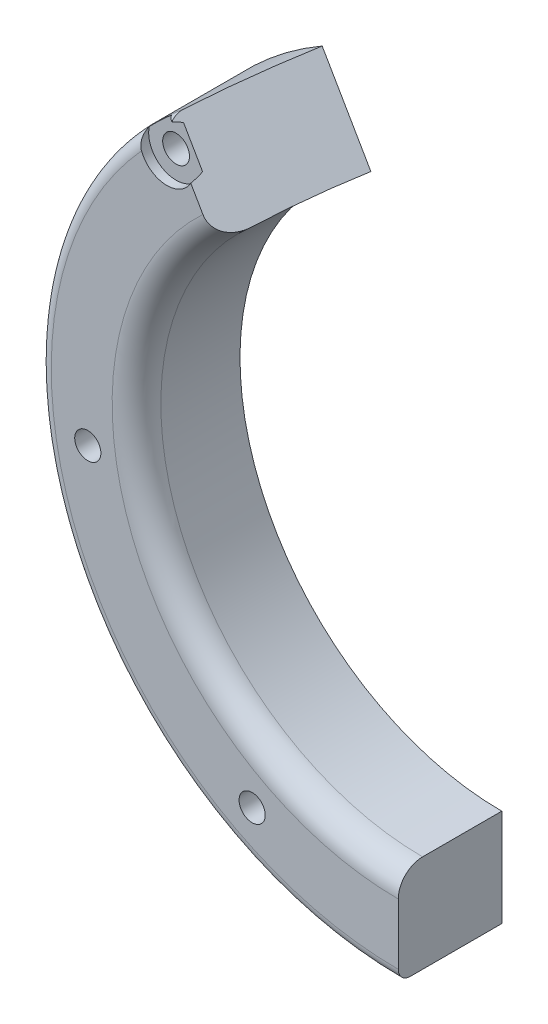
ISO-10303-21;
HEADER;
FILE_DESCRIPTION(('STEP AP214'),'2;1');
FILE_NAME('part.step','',(''),(''),'','','');
FILE_SCHEMA(('AUTOMOTIVE_DESIGN { 1 0 10303 214 1 1 1 1 }'));
ENDSEC;
DATA;
#1=APPLICATION_CONTEXT('core data for automotive mechanical design processes');
#2=APPLICATION_PROTOCOL_DEFINITION('international standard','automotive_design',2000,#1);
#3=PRODUCT_CONTEXT('',#1,'mechanical');
#4=PRODUCT('Part','Part','',(#3));
#5=PRODUCT_RELATED_PRODUCT_CATEGORY('part','',(#4));
#6=PRODUCT_DEFINITION_FORMATION('','',#4);
#7=PRODUCT_DEFINITION_CONTEXT('part definition',#1,'design');
#8=PRODUCT_DEFINITION('design','',#6,#7);
#9=PRODUCT_DEFINITION_SHAPE('','',#8);
#10=(LENGTH_UNIT() NAMED_UNIT(*) SI_UNIT(.MILLI.,.METRE.));
#11=(NAMED_UNIT(*) PLANE_ANGLE_UNIT() SI_UNIT($,.RADIAN.));
#12=(NAMED_UNIT(*) SI_UNIT($,.STERADIAN.) SOLID_ANGLE_UNIT());
#13=UNCERTAINTY_MEASURE_WITH_UNIT(LENGTH_MEASURE(1.E-05),#10,'distance_accuracy_value','');
#14=(GEOMETRIC_REPRESENTATION_CONTEXT(3) GLOBAL_UNCERTAINTY_ASSIGNED_CONTEXT((#13)) GLOBAL_UNIT_ASSIGNED_CONTEXT((#10,
#11,#12)) REPRESENTATION_CONTEXT('',''));
#15=CARTESIAN_POINT('',(0.,0.,0.));
#16=DIRECTION('',(0.,0.,1.));
#17=DIRECTION('',(1.,0.,0.));
#18=AXIS2_PLACEMENT_3D('',#15,#16,#17);
#19=CARTESIAN_POINT('',(-51.,-8.,17.2023186219581));
#20=DIRECTION('',(0.,0.,-1.));
#21=DIRECTION('',(-1.,0.,0.));
#22=AXIS2_PLACEMENT_3D('',#19,#20,#21);
#23=CYLINDRICAL_SURFACE('',#22,1.25000000000001);
#24=CARTESIAN_POINT('',(-51.,-8.,0.));
#25=DIRECTION('',(0.,0.,-1.));
#26=DIRECTION('',(-1.,0.,0.));
#27=AXIS2_PLACEMENT_3D('',#24,#25,#26);
#28=CIRCLE('',#27,1.25000000000001);
#29=CARTESIAN_POINT('',(-52.25,-8.,0.));
#30=VERTEX_POINT('',#29);
#31=EDGE_CURVE('E353',#30,#30,#28,.T.);
#32=ORIENTED_EDGE('',*,*,#31,.T.);
#33=EDGE_LOOP('',(#32));
#34=FACE_BOUND('',#33,.T.);
#35=CARTESIAN_POINT('',(-51.,-8.,3.));
#36=DIRECTION('',(0.,0.,1.));
#37=DIRECTION('',(1.,0.,0.));
#38=AXIS2_PLACEMENT_3D('',#35,#36,#37);
#39=CIRCLE('',#38,1.25000000000001);
#40=CARTESIAN_POINT('',(-49.75,-8.,3.));
#41=VERTEX_POINT('',#40);
#42=EDGE_CURVE('E351',#41,#41,#39,.F.);
#43=ORIENTED_EDGE('',*,*,#42,.F.);
#44=EDGE_LOOP('',(#43));
#45=FACE_BOUND('',#44,.T.);
#46=ADVANCED_FACE('F39',(#34,#45),#23,.F.);
#47=CARTESIAN_POINT('',(-24.,-46.,17.2023186219581));
#48=DIRECTION('',(0.,0.,-1.));
#49=DIRECTION('',(-1.,0.,0.));
#50=AXIS2_PLACEMENT_3D('',#47,#48,#49);
#51=CYLINDRICAL_SURFACE('',#50,1.25);
#52=CARTESIAN_POINT('',(-24.,-46.,0.));
#53=DIRECTION('',(0.,0.,-1.));
#54=DIRECTION('',(-1.,0.,0.));
#55=AXIS2_PLACEMENT_3D('',#52,#53,#54);
#56=CIRCLE('',#55,1.25);
#57=CARTESIAN_POINT('',(-25.25,-46.,0.));
#58=VERTEX_POINT('',#57);
#59=EDGE_CURVE('E186',#58,#58,#56,.T.);
#60=ORIENTED_EDGE('',*,*,#59,.T.);
#61=EDGE_LOOP('',(#60));
#62=FACE_BOUND('',#61,.T.);
#63=CARTESIAN_POINT('',(-24.,-46.,3.));
#64=DIRECTION('',(0.,0.,1.));
#65=DIRECTION('',(1.,0.,0.));
#66=AXIS2_PLACEMENT_3D('',#63,#64,#65);
#67=CIRCLE('',#66,1.25);
#68=CARTESIAN_POINT('',(-22.75,-46.,3.));
#69=VERTEX_POINT('',#68);
#70=EDGE_CURVE('E348',#69,#69,#67,.F.);
#71=ORIENTED_EDGE('',*,*,#70,.F.);
#72=EDGE_LOOP('',(#71));
#73=FACE_BOUND('',#72,.T.);
#74=ADVANCED_FACE('F387',(#62,#73),#51,.F.);
#75=CARTESIAN_POINT('',(-38.,40.,0.));
#76=DIRECTION('',(0.,0.,1.));
#77=DIRECTION('',(1.,0.,0.));
#78=AXIS2_PLACEMENT_3D('',#75,#76,#77);
#79=CYLINDRICAL_SURFACE('',#78,2.2);
#80=CARTESIAN_POINT('',(-38.,40.,0.));
#81=DIRECTION('',(0.,0.,1.));
#82=DIRECTION('',(1.,0.,0.));
#83=AXIS2_PLACEMENT_3D('',#80,#81,#82);
#84=CIRCLE('',#83,2.2);
#85=CARTESIAN_POINT('',(-35.8,40.,0.));
#86=VERTEX_POINT('',#85);
#87=EDGE_CURVE('E224',#86,#86,#84,.T.);
#88=ORIENTED_EDGE('',*,*,#87,.F.);
#89=EDGE_LOOP('',(#88));
#90=FACE_BOUND('',#89,.T.);
#91=CARTESIAN_POINT('',(-38.,40.,2.));
#92=DIRECTION('',(0.,0.,1.));
#93=DIRECTION('',(1.,0.,0.));
#94=AXIS2_PLACEMENT_3D('',#91,#92,#93);
#95=CIRCLE('',#94,2.2);
#96=CARTESIAN_POINT('',(-35.8,40.,2.));
#97=VERTEX_POINT('',#96);
#98=EDGE_CURVE('E201',#97,#97,#95,.F.);
#99=ORIENTED_EDGE('',*,*,#98,.F.);
#100=EDGE_LOOP('',(#99));
#101=FACE_BOUND('',#100,.T.);
#102=ADVANCED_FACE('F300',(#90,#101),#79,.F.);
#103=CARTESIAN_POINT('',(-38.,40.,6.));
#104=DIRECTION('',(0.,0.,1.));
#105=DIRECTION('',(1.,0.,0.));
#106=AXIS2_PLACEMENT_3D('',#103,#104,#105);
#107=CIRCLE('',#106,2.2);
#108=CARTESIAN_POINT('',(-35.8,40.,6.));
#109=VERTEX_POINT('',#108);
#110=EDGE_CURVE('E210',#109,#109,#107,.F.);
#111=ORIENTED_EDGE('',*,*,#110,.T.);
#112=EDGE_LOOP('',(#111));
#113=FACE_BOUND('',#112,.T.);
#114=CARTESIAN_POINT('',(-38.,40.,15.5));
#115=DIRECTION('',(0.,0.,1.));
#116=DIRECTION('',(1.,0.,0.));
#117=AXIS2_PLACEMENT_3D('',#114,#115,#116);
#118=CIRCLE('',#117,2.2);
#119=CARTESIAN_POINT('',(-35.8,40.,15.5));
#120=VERTEX_POINT('',#119);
#121=EDGE_CURVE('E212',#120,#120,#118,.F.);
#122=ORIENTED_EDGE('',*,*,#121,.F.);
#123=EDGE_LOOP('',(#122));
#124=FACE_BOUND('',#123,.T.);
#125=ADVANCED_FACE('F279',(#113,#124),#79,.F.);
#126=CARTESIAN_POINT('',(0.,0.,17.));
#127=DIRECTION('',(0.,0.,-1.));
#128=DIRECTION('',(-1.,0.,0.));
#129=AXIS2_PLACEMENT_3D('',#126,#127,#128);
#130=CYLINDRICAL_SURFACE('',#129,43.);
#131=DIRECTION('',(0.,0.,-1.));
#132=VECTOR('',#131,1.);
#133=CARTESIAN_POINT('',(-33.2355244808769,27.2836931605865,17.));
#134=LINE('',#133,#132);
#135=CARTESIAN_POINT('',(-33.2355244808769,27.2836931605865,2.));
#136=VERTEX_POINT('',#135);
#137=CARTESIAN_POINT('',(-33.2355244808769,27.2836931605865,6.));
#138=VERTEX_POINT('',#137);
#139=EDGE_CURVE('E343',#136,#138,#134,.F.);
#140=ORIENTED_EDGE('',*,*,#139,.T.);
#141=CARTESIAN_POINT('',(0.,0.,6.));
#142=DIRECTION('',(0.,0.,1.));
#143=DIRECTION('',(1.,0.,0.));
#144=AXIS2_PLACEMENT_3D('',#141,#142,#143);
#145=CIRCLE('',#144,43.);
#146=CARTESIAN_POINT('',(-26.3105496569665,34.011100787071,6.));
#147=VERTEX_POINT('',#146);
#148=EDGE_CURVE('E163',#138,#147,#145,.F.);
#149=ORIENTED_EDGE('',*,*,#148,.T.);
#150=DIRECTION('',(0.,0.,-1.));
#151=VECTOR('',#150,1.);
#152=CARTESIAN_POINT('',(-26.3105496569665,34.011100787071,17.));
#153=LINE('',#152,#151);
#154=CARTESIAN_POINT('',(-26.3105496569665,34.011100787071,2.));
#155=VERTEX_POINT('',#154);
#156=EDGE_CURVE('E344',#147,#155,#153,.T.);
#157=ORIENTED_EDGE('',*,*,#156,.T.);
#158=CARTESIAN_POINT('',(0.,0.,2.));
#159=DIRECTION('',(0.,0.,1.));
#160=DIRECTION('',(1.,0.,0.));
#161=AXIS2_PLACEMENT_3D('',#158,#159,#160);
#162=CIRCLE('',#161,43.);
#163=EDGE_CURVE('E338',#136,#155,#162,.F.);
#164=ORIENTED_EDGE('',*,*,#163,.F.);
#165=EDGE_LOOP('',(#140,#149,#157,#164));
#166=FACE_BOUND('',#165,.T.);
#167=CARTESIAN_POINT('',(0.,0.,0.));
#168=DIRECTION('',(0.734431194902493,0.424024048078214,0.529919264233205));
#169=DIRECTION('',(0.458923544780714,0.264959632116603,-0.848048096156426));
#170=AXIS2_PLACEMENT_3D('',#167,#168,#169);
#171=ELLIPSE('',#170,81.1444363363938,43.);
#172=CARTESIAN_POINT('',(-21.5000000000001,37.2390923627308,0.));
#173=VERTEX_POINT('',#172);
#174=CARTESIAN_POINT('',(-28.147848735378,32.5069009837954,13.));
#175=VERTEX_POINT('',#174);
#176=EDGE_CURVE('E230',#173,#175,#171,.T.);
#177=ORIENTED_EDGE('',*,*,#176,.T.);
#178=CARTESIAN_POINT('',(0.,0.,13.));
#179=DIRECTION('',(0.,0.,1.));
#180=DIRECTION('',(1.,0.,0.));
#181=AXIS2_PLACEMENT_3D('',#178,#179,#180);
#182=CIRCLE('',#181,43.);
#183=CARTESIAN_POINT('',(0.,-43.,13.));
#184=VERTEX_POINT('',#183);
#185=EDGE_CURVE('E263',#175,#184,#182,.T.);
#186=ORIENTED_EDGE('',*,*,#185,.T.);
#187=DIRECTION('',(0.,0.,-1.));
#188=VECTOR('',#187,1.);
#189=CARTESIAN_POINT('',(0.,-43.,17.));
#190=LINE('',#189,#188);
#191=CARTESIAN_POINT('',(0.,-43.,0.));
#192=VERTEX_POINT('',#191);
#193=EDGE_CURVE('E235',#184,#192,#190,.T.);
#194=ORIENTED_EDGE('',*,*,#193,.T.);
#195=CARTESIAN_POINT('',(0.,0.,0.));
#196=DIRECTION('',(0.,0.,-1.));
#197=DIRECTION('',(1.,0.,0.));
#198=AXIS2_PLACEMENT_3D('',#195,#196,#197);
#199=CIRCLE('',#198,43.);
#200=EDGE_CURVE('E226',#192,#173,#199,.T.);
#201=ORIENTED_EDGE('',*,*,#200,.T.);
#202=EDGE_LOOP('',(#177,#186,#194,#201));
#203=FACE_BOUND('',#202,.T.);
#204=ADVANCED_FACE('F273',(#166,#203),#130,.F.);
#205=CARTESIAN_POINT('',(0.,0.,17.));
#206=DIRECTION('',(0.,0.,-1.));
#207=DIRECTION('',(-1.,0.,0.));
#208=AXIS2_PLACEMENT_3D('',#205,#206,#207);
#209=CYLINDRICAL_SURFACE('',#208,59.);
#210=DIRECTION('',(0.,0.,-1.));
#211=VECTOR('',#210,1.);
#212=CARTESIAN_POINT('',(0.,-59.,17.));
#213=LINE('',#212,#211);
#214=CARTESIAN_POINT('',(0.,-59.,15.));
#215=VERTEX_POINT('',#214);
#216=CARTESIAN_POINT('',(0.,-59.,0.));
#217=VERTEX_POINT('',#216);
#218=EDGE_CURVE('E223',#215,#217,#213,.T.);
#219=ORIENTED_EDGE('',*,*,#218,.F.);
#220=CARTESIAN_POINT('',(0.,0.,15.));
#221=DIRECTION('',(0.,0.,1.));
#222=DIRECTION('',(1.,0.,0.));
#223=AXIS2_PLACEMENT_3D('',#220,#221,#222);
#224=CIRCLE('',#223,59.);
#225=CARTESIAN_POINT('',(-37.2426498564599,45.7600812026063,15.));
#226=VERTEX_POINT('',#225);
#227=EDGE_CURVE('E52',#215,#226,#224,.F.);
#228=ORIENTED_EDGE('',*,*,#227,.T.);
#229=CARTESIAN_POINT('',(0.,0.,0.));
#230=DIRECTION('',(0.734431194902493,0.424024048078214,0.529919264233205));
#231=DIRECTION('',(0.458923544780714,0.264959632116603,-0.848048096156426));
#232=AXIS2_PLACEMENT_3D('',#229,#230,#231);
#233=ELLIPSE('',#232,111.337714973192,59.);
#234=CARTESIAN_POINT('',(-29.5000000000001,51.0954988232818,0.));
#235=VERTEX_POINT('',#234);
#236=EDGE_CURVE('E244',#226,#235,#233,.F.);
#237=ORIENTED_EDGE('',*,*,#236,.T.);
#238=CARTESIAN_POINT('',(0.,0.,0.));
#239=DIRECTION('',(0.,0.,1.));
#240=DIRECTION('',(1.,0.,0.));
#241=AXIS2_PLACEMENT_3D('',#238,#239,#240);
#242=CIRCLE('',#241,59.);
#243=EDGE_CURVE('E236',#235,#217,#242,.T.);
#244=ORIENTED_EDGE('',*,*,#243,.T.);
#245=EDGE_LOOP('',(#219,#228,#237,#244));
#246=FACE_BOUND('',#245,.T.);
#247=ADVANCED_FACE('F277',(#246),#209,.T.);
#248=CARTESIAN_POINT('',(0.,-43.,17.));
#249=DIRECTION('',(-1.,0.,0.));
#250=DIRECTION('',(0.,-1.,0.));
#251=AXIS2_PLACEMENT_3D('',#248,#249,#250);
#252=PLANE('',#251);
#253=DIRECTION('',(0.,1.,0.));
#254=VECTOR('',#253,1.);
#255=CARTESIAN_POINT('',(0.,-43.,17.));
#256=LINE('',#255,#254);
#257=CARTESIAN_POINT('',(0.,-57.,17.));
#258=VERTEX_POINT('',#257);
#259=CARTESIAN_POINT('',(0.,-47.,17.));
#260=VERTEX_POINT('',#259);
#261=EDGE_CURVE('E229',#258,#260,#256,.T.);
#262=ORIENTED_EDGE('',*,*,#261,.F.);
#263=CARTESIAN_POINT('',(0.,-57.,15.));
#264=DIRECTION('',(-1.,0.,0.));
#265=DIRECTION('',(0.,-1.,0.));
#266=AXIS2_PLACEMENT_3D('',#263,#264,#265);
#267=CIRCLE('',#266,2.);
#268=EDGE_CURVE('E66',#258,#215,#267,.F.);
#269=ORIENTED_EDGE('',*,*,#268,.T.);
#270=ORIENTED_EDGE('',*,*,#218,.T.);
#271=DIRECTION('',(0.,1.,0.));
#272=VECTOR('',#271,1.);
#273=CARTESIAN_POINT('',(0.,-43.,0.));
#274=LINE('',#273,#272);
#275=EDGE_CURVE('E231',#217,#192,#274,.T.);
#276=ORIENTED_EDGE('',*,*,#275,.T.);
#277=ORIENTED_EDGE('',*,*,#193,.F.);
#278=CARTESIAN_POINT('',(0.,-47.,13.));
#279=DIRECTION('',(-1.,0.,0.));
#280=DIRECTION('',(0.,-1.,0.));
#281=AXIS2_PLACEMENT_3D('',#278,#279,#280);
#282=CIRCLE('',#281,4.);
#283=EDGE_CURVE('E334',#184,#260,#282,.F.);
#284=ORIENTED_EDGE('',*,*,#283,.T.);
#285=EDGE_LOOP('',(#262,#269,#270,#276,#277,#284));
#286=FACE_BOUND('',#285,.T.);
#287=ADVANCED_FACE('F283',(#286),#252,.F.);
#288=CARTESIAN_POINT('',(0.,0.,17.));
#289=DIRECTION('',(0.,0.,1.));
#290=DIRECTION('',(1.,0.,0.));
#291=AXIS2_PLACEMENT_3D('',#288,#289,#290);
#292=PLANE('',#291);
#293=CARTESIAN_POINT('',(-51.,-8.,17.));
#294=DIRECTION('',(0.,0.,1.));
#295=DIRECTION('',(1.,0.,0.));
#296=AXIS2_PLACEMENT_3D('',#293,#294,#295);
#297=CIRCLE('',#296,2.15);
#298=CARTESIAN_POINT('',(-48.85,-8.,17.));
#299=VERTEX_POINT('',#298);
#300=EDGE_CURVE('E606',#299,#299,#297,.T.);
#301=ORIENTED_EDGE('',*,*,#300,.F.);
#302=EDGE_LOOP('',(#301));
#303=FACE_BOUND('',#302,.T.);
#304=CARTESIAN_POINT('',(-24.,-46.,17.));
#305=DIRECTION('',(0.,0.,1.));
#306=DIRECTION('',(1.,0.,0.));
#307=AXIS2_PLACEMENT_3D('',#304,#305,#306);
#308=CIRCLE('',#307,2.15);
#309=CARTESIAN_POINT('',(-21.85,-46.,17.));
#310=VERTEX_POINT('',#309);
#311=EDGE_CURVE('E607',#310,#310,#308,.T.);
#312=ORIENTED_EDGE('',*,*,#311,.F.);
#313=EDGE_LOOP('',(#312));
#314=FACE_BOUND('',#313,.T.);
#315=CARTESIAN_POINT('',(-38.,40.,17.));
#316=DIRECTION('',(0.,0.,1.));
#317=DIRECTION('',(1.,0.,0.));
#318=AXIS2_PLACEMENT_3D('',#315,#316,#317);
#319=CIRCLE('',#318,4.5);
#320=CARTESIAN_POINT('',(-42.1814411983743,38.3370058615444,17.));
#321=VERTEX_POINT('',#320);
#322=CARTESIAN_POINT('',(-34.0821060863576,37.7863814056066,17.));
#323=VERTEX_POINT('',#322);
#324=EDGE_CURVE('E208',#321,#323,#319,.T.);
#325=ORIENTED_EDGE('',*,*,#324,.F.);
#326=CARTESIAN_POINT('',(0.,0.,17.));
#327=DIRECTION('',(0.,0.,1.));
#328=DIRECTION('',(1.,0.,0.));
#329=AXIS2_PLACEMENT_3D('',#326,#327,#328);
#330=CIRCLE('',#329,57.);
#331=EDGE_CURVE('E325',#321,#258,#330,.T.);
#332=ORIENTED_EDGE('',*,*,#331,.T.);
#333=ORIENTED_EDGE('',*,*,#261,.T.);
#334=CARTESIAN_POINT('',(0.,0.,17.));
#335=DIRECTION('',(0.,0.,1.));
#336=DIRECTION('',(1.,0.,0.));
#337=AXIS2_PLACEMENT_3D('',#334,#335,#336);
#338=CIRCLE('',#337,47.);
#339=CARTESIAN_POINT('',(-32.0914976821008,34.3385465114602,17.));
#340=VERTEX_POINT('',#339);
#341=EDGE_CURVE('E253',#260,#340,#338,.F.);
#342=ORIENTED_EDGE('',*,*,#341,.T.);
#343=DIRECTION('',(-0.500000000000001,0.866025403784438,0.));
#344=VECTOR('',#343,1.);
#345=CARTESIAN_POINT('',(-9.19959645759653,-5.3113894912293,17.));
#346=LINE('',#345,#344);
#347=EDGE_CURVE('E218',#323,#340,#346,.F.);
#348=ORIENTED_EDGE('',*,*,#347,.F.);
#349=EDGE_LOOP('',(#325,#332,#333,#342,#348));
#350=FACE_BOUND('',#349,.T.);
#351=ADVANCED_FACE('F287',(#303,#314,#350),#292,.T.);
#352=CARTESIAN_POINT('',(0.,0.,0.));
#353=DIRECTION('',(0.,0.,1.));
#354=DIRECTION('',(1.,0.,0.));
#355=AXIS2_PLACEMENT_3D('',#352,#353,#354);
#356=PLANE('',#355);
#357=ORIENTED_EDGE('',*,*,#59,.F.);
#358=EDGE_LOOP('',(#357));
#359=FACE_BOUND('',#358,.T.);
#360=ORIENTED_EDGE('',*,*,#31,.F.);
#361=EDGE_LOOP('',(#360));
#362=FACE_BOUND('',#361,.T.);
#363=ORIENTED_EDGE('',*,*,#87,.T.);
#364=EDGE_LOOP('',(#363));
#365=FACE_BOUND('',#364,.T.);
#366=ORIENTED_EDGE('',*,*,#243,.F.);
#367=DIRECTION('',(0.500000000000001,-0.866025403784438,0.));
#368=VECTOR('',#367,1.);
#369=CARTESIAN_POINT('',(0.,0.,0.));
#370=LINE('',#369,#368);
#371=EDGE_CURVE('E220',#235,#173,#370,.T.);
#372=ORIENTED_EDGE('',*,*,#371,.T.);
#373=ORIENTED_EDGE('',*,*,#200,.F.);
#374=ORIENTED_EDGE('',*,*,#275,.F.);
#375=EDGE_LOOP('',(#366,#372,#373,#374));
#376=FACE_BOUND('',#375,.T.);
#377=ADVANCED_FACE('F271',(#359,#362,#365,#376),#356,.F.);
#378=CARTESIAN_POINT('',(0.,0.,0.));
#379=DIRECTION('',(0.734431194902493,0.424024048078214,0.529919264233205));
#380=DIRECTION('',(-0.458923544780714,-0.264959632116603,0.848048096156426));
#381=AXIS2_PLACEMENT_3D('',#378,#379,#380);
#382=PLANE('',#381);
#383=ORIENTED_EDGE('',*,*,#236,.F.);
#384=CARTESIAN_POINT('',(-37.2426498564599,45.7600812026063,15.));
#385=CARTESIAN_POINT('',(-37.3131660583271,45.70268137367,15.143660008911));
#386=CARTESIAN_POINT('',(-37.3751720418364,45.6320080511825,15.2861464628832));
#387=CARTESIAN_POINT('',(-37.4808591790824,45.4666639852444,15.5649243836519));
#388=CARTESIAN_POINT('',(-37.5244437778289,45.3718708700007,15.7011799498594));
#389=CARTESIAN_POINT('',(-37.5886857848751,45.1694769847509,15.9521638591162));
#390=CARTESIAN_POINT('',(-37.6108323784491,45.0633945577961,16.067741180838));
#391=CARTESIAN_POINT('',(-37.6362524301185,44.8362480599751,16.2847267939225));
#392=CARTESIAN_POINT('',(-37.6396131588653,44.7152559384838,16.3861984647955));
#393=CARTESIAN_POINT('',(-37.6311285214431,44.5541179898986,16.5033766597563));
#394=CARTESIAN_POINT('',(-37.6285939944917,44.5194433713804,16.5276094765625));
#395=CARTESIAN_POINT('',(-37.625313884209,44.4843740159172,16.5511248223778));
#396=B_SPLINE_CURVE_WITH_KNOTS('',3,(#384,#385,#386,#387,#388,#389,#390,#391,#392,#393,#394,
#395),.UNSPECIFIED.,.F.,.F.,(4,2,2,2,2,4),(0.,0.509320768213792,1.0212789748977,
1.49437659974831,1.96527458837673,2.0923565871867),.UNSPECIFIED.);
#397=CARTESIAN_POINT('',(-37.625313884209,44.4843740159172,16.5511248223778));
#398=VERTEX_POINT('',#397);
#399=EDGE_CURVE('E11',#226,#398,#396,.T.);
#400=ORIENTED_EDGE('',*,*,#399,.T.);
#401=CARTESIAN_POINT('',(-38.,40.,20.6586629738911));
#402=DIRECTION('',(0.734431194902493,0.424024048078214,0.529919264233205));
#403=DIRECTION('',(-0.458923544780714,-0.264959632116603,0.848048096156426));
#404=AXIS2_PLACEMENT_3D('',#401,#402,#403);
#405=ELLIPSE('',#404,8.49185961659935,4.5);
#406=CARTESIAN_POINT('',(-36.7783363978237,44.3309973497011,15.5));
#407=VERTEX_POINT('',#406);
#408=EDGE_CURVE('E251',#398,#407,#405,.F.);
#409=ORIENTED_EDGE('',*,*,#408,.T.);
#410=DIRECTION('',(0.500000000000001,-0.866025403784438,0.));
#411=VECTOR('',#410,1.);
#412=CARTESIAN_POINT('',(-8.38786735839684,-4.84273747729731,15.5));
#413=LINE('',#412,#411);
#414=CARTESIAN_POINT('',(-33.6384144703477,38.8924930395129,15.5));
#415=VERTEX_POINT('',#414);
#416=EDGE_CURVE('E222',#415,#407,#413,.F.);
#417=ORIENTED_EDGE('',*,*,#416,.F.);
#418=EDGE_CURVE('E252',#415,#323,#405,.F.);
#419=ORIENTED_EDGE('',*,*,#418,.T.);
#420=ORIENTED_EDGE('',*,*,#347,.T.);
#421=CARTESIAN_POINT('',(-32.0914976821008,34.3385465114602,17.));
#422=CARTESIAN_POINT('',(-32.0441173314115,34.2564653410961,17.0000127992273));
#423=CARTESIAN_POINT('',(-31.9949860389986,34.1753774028337,16.9968041633533));
#424=CARTESIAN_POINT('',(-31.8934831136155,34.0157627677575,16.9838465836971));
#425=CARTESIAN_POINT('',(-31.8411105360081,33.93723682789,16.9740957250299));
#426=CARTESIAN_POINT('',(-31.7334464469897,33.7834151604823,16.947963858566));
#427=CARTESIAN_POINT('',(-31.6781566771879,33.7081175531807,16.9315867686422));
#428=CARTESIAN_POINT('',(-31.5649863733266,33.5613068483403,16.8922137291379));
#429=CARTESIAN_POINT('',(-31.507106164156,33.4897932786548,16.8692186076274));
#430=CARTESIAN_POINT('',(-31.3890251447208,33.3509649601313,16.8166524141126));
#431=CARTESIAN_POINT('',(-31.3288198814839,33.2836589880112,16.7870681477566));
#432=CARTESIAN_POINT('',(-31.2066186680223,33.1538976232157,16.7215365727031));
#433=CARTESIAN_POINT('',(-31.1446220637796,33.0914440336437,16.685586914798));
#434=CARTESIAN_POINT('',(-31.0193896726579,32.9719237409141,16.607659767988));
#435=CARTESIAN_POINT('',(-30.956155308888,32.9148512450589,16.5656888865403));
#436=CARTESIAN_POINT('',(-30.8288516621945,32.8063604438328,16.4760656857115));
#437=CARTESIAN_POINT('',(-30.7647820741045,32.7549442737845,16.4284112347758));
#438=CARTESIAN_POINT('',(-30.5741393287454,32.6112107579899,16.2792045208507));
#439=CARTESIAN_POINT('',(-30.4469686946875,32.5273565106221,16.1700523023634));
#440=CARTESIAN_POINT('',(-30.1945159297716,32.3835950524079,15.9352035645956));
#441=CARTESIAN_POINT('',(-30.0692349981731,32.3237024798956,15.8094969942896));
#442=CARTESIAN_POINT('',(-29.8132354797143,32.2236089823506,15.534791030483));
#443=CARTESIAN_POINT('',(-29.6828893225016,32.1853779845714,15.3847315272351));
#444=CARTESIAN_POINT('',(-29.4297718975868,32.1349271913105,15.0742974774717));
#445=CARTESIAN_POINT('',(-29.3070041966,32.1227195541554,14.9139181454802));
#446=CARTESIAN_POINT('',(-29.0508625327763,32.1222830057516,14.5592729497127));
#447=CARTESIAN_POINT('',(-28.9191390904876,32.1383970598648,14.3638194937553));
#448=CARTESIAN_POINT('',(-28.6696743191747,32.2000606268362,13.9687375265606));
#449=CARTESIAN_POINT('',(-28.5519360069393,32.2456164771019,13.7691081253966));
#450=CARTESIAN_POINT('',(-28.3893006832174,32.3323207902104,13.474328940136));
#451=CARTESIAN_POINT('',(-28.3385631147339,32.3632700353728,13.3792456309089));
#452=CARTESIAN_POINT('',(-28.2405802716269,32.4308723756855,13.1893550544877));
#453=CARTESIAN_POINT('',(-28.1933336946351,32.4675233277171,13.0945476971552));
#454=CARTESIAN_POINT('',(-28.147848735378,32.5069009837954,13.));
#455=B_SPLINE_CURVE_WITH_KNOTS('',3,(#421,#422,#423,#424,#425,#426,#427,#428,#429,#430,#431,
#432,#433,#434,#435,#436,#437,#438,#439,#440,#441,#442,#443,#444,#445,#446,#447,#448,#449,#450,
#451,#452,#453,#454),.UNSPECIFIED.,.F.,.F.,(4,2,2,2,2,2,2,2,2,2,2,2,2,2,2,2,4),(0.,
0.284270435740037,0.568624112725402,0.852809905844514,1.13696015614454,1.42168459862633,
1.70651434119904,1.99103388012647,2.27566046224159,2.83520868576079,3.39509822065792,
3.99999454163373,4.60517341322725,5.31137529450041,6.01772923784115,6.35395134248585,
6.69004737425372),.UNSPECIFIED.);
#456=EDGE_CURVE('E256',#340,#175,#455,.T.);
#457=ORIENTED_EDGE('',*,*,#456,.T.);
#458=ORIENTED_EDGE('',*,*,#176,.F.);
#459=ORIENTED_EDGE('',*,*,#371,.F.);
#460=EDGE_LOOP('',(#383,#400,#409,#417,#419,#420,#457,#458,#459));
#461=FACE_BOUND('',#460,.T.);
#462=ADVANCED_FACE('F267',(#461),#382,.T.);
#463=CARTESIAN_POINT('',(-38.,40.,15.5));
#464=DIRECTION('',(0.,0.,1.));
#465=DIRECTION('',(1.,0.,0.));
#466=AXIS2_PLACEMENT_3D('',#463,#464,#465);
#467=CYLINDRICAL_SURFACE('',#466,4.5);
#468=ORIENTED_EDGE('',*,*,#408,.F.);
#469=CARTESIAN_POINT('',(-37.625313884209,44.4843740159172,16.5511248223778));
#470=CARTESIAN_POINT('',(-37.6983783613772,44.4904952169297,16.5088745260641));
#471=CARTESIAN_POINT('',(-37.7702051350384,44.4946823459739,16.4641731363524));
#472=CARTESIAN_POINT('',(-37.910848099808,44.4996643659715,16.3696612265684));
#473=CARTESIAN_POINT('',(-37.9796546444238,44.5004490740053,16.3198358260135));
#474=CARTESIAN_POINT('',(-38.1134580633845,44.4990692521196,16.2149781406572));
#475=CARTESIAN_POINT('',(-38.1784440433759,44.4968966782383,16.1599320346391));
#476=CARTESIAN_POINT('',(-38.3032125728569,44.4902055775834,16.0444744867865));
#477=CARTESIAN_POINT('',(-38.3630036142652,44.4856909667903,15.9840721401411));
#478=CARTESIAN_POINT('',(-38.4385440832511,44.4786218110678,15.8991658901473));
#479=CARTESIAN_POINT('',(-38.4573221009123,44.4767394874074,15.8772726075873));
#480=CARTESIAN_POINT('',(-38.4939723187367,44.4728436841077,15.8327978574423));
#481=CARTESIAN_POINT('',(-38.5118455957563,44.4708303672343,15.8102172617774));
#482=CARTESIAN_POINT('',(-38.5632148626085,44.4647455809901,15.7424025846236));
#483=CARTESIAN_POINT('',(-38.5953412478078,44.4605436535869,15.6961156869489));
#484=CARTESIAN_POINT('',(-38.654959419001,44.4521859186556,15.6004048821661));
#485=CARTESIAN_POINT('',(-38.6824323163923,44.4480303601717,15.550969260338));
#486=CARTESIAN_POINT('',(-38.706982851157,44.4441169255736,15.5));
#487=B_SPLINE_CURVE_WITH_KNOTS('',3,(#469,#470,#471,#472,#473,#474,#475,#476,#477,#478,#479,
#480,#481,#482,#483,#484,#485,#486),.UNSPECIFIED.,.F.,.F.,(4,2,2,2,2,2,2,2,4),(0.,
0.253826358950735,0.508411858842638,0.763691230179856,1.01854513328556,1.10524005959743,
1.19182924749542,1.36105692109188,1.53095583682827),.UNSPECIFIED.);
#488=CARTESIAN_POINT('',(-38.706982851157,44.4441169255736,15.5));
#489=VERTEX_POINT('',#488);
#490=EDGE_CURVE('E308',#398,#489,#487,.T.);
#491=ORIENTED_EDGE('',*,*,#490,.T.);
#492=CARTESIAN_POINT('',(-38.,40.,15.5));
#493=DIRECTION('',(0.,0.,1.));
#494=DIRECTION('',(1.,0.,0.));
#495=AXIS2_PLACEMENT_3D('',#492,#493,#494);
#496=CIRCLE('',#495,4.5);
#497=EDGE_CURVE('E213',#407,#489,#496,.T.);
#498=ORIENTED_EDGE('',*,*,#497,.F.);
#499=EDGE_LOOP('',(#468,#491,#498));
#500=FACE_BOUND('',#499,.T.);
#501=ADVANCED_FACE('F275',(#500),#467,.F.);
#502=CARTESIAN_POINT('',(-42.4020453774518,40.9338075255936,15.5));
#503=VERTEX_POINT('',#502);
#504=EDGE_CURVE('E214',#503,#415,#496,.T.);
#505=ORIENTED_EDGE('',*,*,#504,.F.);
#506=CARTESIAN_POINT('',(-42.4020453774518,40.9338075255936,15.5));
#507=CARTESIAN_POINT('',(-42.4077924255814,40.9067712668251,15.5566286511159));
#508=CARTESIAN_POINT('',(-42.4140104676027,40.8761874330857,15.6113407298066));
#509=CARTESIAN_POINT('',(-42.4267385673914,40.809385689371,15.7169205023316));
#510=CARTESIAN_POINT('',(-42.4332474849238,40.7731886042738,15.7678014127928));
#511=CARTESIAN_POINT('',(-42.4459093109943,40.6967006851029,15.8657381449159));
#512=CARTESIAN_POINT('',(-42.4520645688716,40.6564434097022,15.9128203315046));
#513=CARTESIAN_POINT('',(-42.4636486580726,40.5724006345643,16.0039021422645));
#514=CARTESIAN_POINT('',(-42.4690766167376,40.5286109955893,16.047898033692));
#515=CARTESIAN_POINT('',(-42.4806639221673,40.4213498321244,16.1487875707084));
#516=CARTESIAN_POINT('',(-42.4863450099847,40.3566132843943,16.204395694912));
#517=CARTESIAN_POINT('',(-42.494976484106,40.222924652242,16.310424162877));
#518=CARTESIAN_POINT('',(-42.4979269673846,40.1539727176179,16.3608446908144));
#519=CARTESIAN_POINT('',(-42.5018494502298,39.941057193623,16.5051901559803));
#520=CARTESIAN_POINT('',(-42.4978111333515,39.7916880017194,16.5916039541722));
#521=CARTESIAN_POINT('',(-42.4791249632662,39.5599986527026,16.7053856557946));
#522=CARTESIAN_POINT('',(-42.4706984133583,39.4809785024694,16.7408437062592));
#523=CARTESIAN_POINT('',(-42.449217485708,39.3210647598702,16.8057873110302));
#524=CARTESIAN_POINT('',(-42.4361621057492,39.2401707653346,16.8352715697402));
#525=CARTESIAN_POINT('',(-42.4052368588862,39.0776685675312,16.8875085456511));
#526=CARTESIAN_POINT('',(-42.3873953866893,38.9960672384336,16.9102993544706));
#527=CARTESIAN_POINT('',(-42.3467161312285,38.8324595262635,16.9486629148819));
#528=CARTESIAN_POINT('',(-42.3238829080861,38.7504535792214,16.9642422141828));
#529=CARTESIAN_POINT('',(-42.2813199114425,38.6130273100524,16.9837177775432));
#530=CARTESIAN_POINT('',(-42.2629314545174,38.5574886711731,16.9897567399911));
#531=CARTESIAN_POINT('',(-42.2238765624401,38.4468328191185,16.9979012113355));
#532=CARTESIAN_POINT('',(-42.203206670251,38.3917163846706,17.0000006616269));
#533=CARTESIAN_POINT('',(-42.1814411983743,38.3370058615444,17.));
#534=B_SPLINE_CURVE_WITH_KNOTS('',3,(#506,#507,#508,#509,#510,#511,#512,#513,#514,#515,#516,
#517,#518,#519,#520,#521,#522,#523,#524,#525,#526,#527,#528,#529,#530,#531,#532,#533),
.UNSPECIFIED.,.F.,.F.,(4,2,2,2,2,2,2,2,2,2,2,2,2,4),(0.,0.188686444289959,0.376688917585035,
0.563248191370222,0.750029343463055,1.00624746862943,1.26245649410671,1.77750956462635,
2.03831349892136,2.29917393598931,2.55851972785229,2.81762958189404,2.99390766633958,
3.17045662867841),.UNSPECIFIED.);
#535=EDGE_CURVE('E317',#503,#321,#534,.T.);
#536=ORIENTED_EDGE('',*,*,#535,.T.);
#537=ORIENTED_EDGE('',*,*,#324,.T.);
#538=ORIENTED_EDGE('',*,*,#418,.F.);
#539=EDGE_LOOP('',(#505,#536,#537,#538));
#540=FACE_BOUND('',#539,.T.);
#541=ADVANCED_FACE('F305',(#540),#467,.F.);
#542=CARTESIAN_POINT('',(-38.,40.,15.5));
#543=DIRECTION('',(0.,0.,1.));
#544=DIRECTION('',(1.,0.,0.));
#545=AXIS2_PLACEMENT_3D('',#542,#543,#544);
#546=PLANE('',#545);
#547=ORIENTED_EDGE('',*,*,#121,.T.);
#548=EDGE_LOOP('',(#547));
#549=FACE_BOUND('',#548,.T.);
#550=ORIENTED_EDGE('',*,*,#497,.T.);
#551=CARTESIAN_POINT('',(0.,0.,15.5));
#552=DIRECTION('',(0.,0.,1.));
#553=DIRECTION('',(1.,0.,0.));
#554=AXIS2_PLACEMENT_3D('',#551,#552,#553);
#555=CIRCLE('',#554,58.9364916731037);
#556=EDGE_CURVE('E321',#489,#503,#555,.T.);
#557=ORIENTED_EDGE('',*,*,#556,.T.);
#558=ORIENTED_EDGE('',*,*,#504,.T.);
#559=ORIENTED_EDGE('',*,*,#416,.T.);
#560=EDGE_LOOP('',(#550,#557,#558,#559));
#561=FACE_BOUND('',#560,.T.);
#562=ADVANCED_FACE('F302',(#549,#561),#546,.T.);
#563=CARTESIAN_POINT('',(0.,0.,13.));
#564=DIRECTION('',(0.,0.,1.));
#565=DIRECTION('',(1.,0.,0.));
#566=AXIS2_PLACEMENT_3D('',#563,#564,#565);
#567=TOROIDAL_SURFACE('',#566,47.,4.);
#568=ORIENTED_EDGE('',*,*,#283,.F.);
#569=ORIENTED_EDGE('',*,*,#185,.F.);
#570=ORIENTED_EDGE('',*,*,#456,.F.);
#571=ORIENTED_EDGE('',*,*,#341,.F.);
#572=EDGE_LOOP('',(#568,#569,#570,#571));
#573=FACE_BOUND('',#572,.T.);
#574=ADVANCED_FACE('F266',(#573),#567,.T.);
#575=CARTESIAN_POINT('',(-35.0856320104707,42.8826710799084,6.));
#576=DIRECTION('',(0.710962454903831,0.703229967874747,0.));
#577=DIRECTION('',(-0.703229967874747,0.710962454903831,0.));
#578=AXIS2_PLACEMENT_3D('',#575,#576,#577);
#579=PLANE('',#578);
#580=DIRECTION('',(0.703229967874747,-0.710962454903831,0.));
#581=VECTOR('',#580,1.);
#582=CARTESIAN_POINT('',(-35.0856320104707,42.8826710799084,6.));
#583=LINE('',#582,#581);
#584=CARTESIAN_POINT('',(-35.0856320104707,42.8826710799084,6.));
#585=VERTEX_POINT('',#584);
#586=EDGE_CURVE('E164',#585,#147,#583,.T.);
#587=ORIENTED_EDGE('',*,*,#586,.F.);
#588=DIRECTION('',(0.,0.,-1.));
#589=VECTOR('',#588,1.);
#590=CARTESIAN_POINT('',(-35.0856320104707,42.8826710799084,6.));
#591=LINE('',#590,#589);
#592=CARTESIAN_POINT('',(-35.0856320104707,42.8826710799084,2.));
#593=VERTEX_POINT('',#592);
#594=EDGE_CURVE('E198',#585,#593,#591,.T.);
#595=ORIENTED_EDGE('',*,*,#594,.T.);
#596=DIRECTION('',(0.703229967874747,-0.710962454903831,0.));
#597=VECTOR('',#596,1.);
#598=CARTESIAN_POINT('',(-35.0856320104707,42.8826710799084,2.));
#599=LINE('',#598,#597);
#600=EDGE_CURVE('E187',#593,#155,#599,.T.);
#601=ORIENTED_EDGE('',*,*,#600,.T.);
#602=ORIENTED_EDGE('',*,*,#156,.F.);
#603=EDGE_LOOP('',(#587,#595,#601,#602));
#604=FACE_BOUND('',#603,.T.);
#605=ADVANCED_FACE('F373',(#604),#579,.F.);
#606=CARTESIAN_POINT('',(-40.9143679895293,37.1173289200916,6.));
#607=DIRECTION('',(-0.788167618649444,-0.61546064448709,0.));
#608=DIRECTION('',(0.61546064448709,-0.788167618649444,0.));
#609=AXIS2_PLACEMENT_3D('',#606,#607,#608);
#610=PLANE('',#609);
#611=DIRECTION('',(-0.61546064448709,0.788167618649444,0.));
#612=VECTOR('',#611,1.);
#613=CARTESIAN_POINT('',(-40.9143679895293,37.1173289200916,2.));
#614=LINE('',#613,#612);
#615=CARTESIAN_POINT('',(-40.9143679895293,37.1173289200916,2.));
#616=VERTEX_POINT('',#615);
#617=EDGE_CURVE('E167',#136,#616,#614,.T.);
#618=ORIENTED_EDGE('',*,*,#617,.T.);
#619=DIRECTION('',(0.,0.,-1.));
#620=VECTOR('',#619,1.);
#621=CARTESIAN_POINT('',(-40.9143679895293,37.1173289200916,6.));
#622=LINE('',#621,#620);
#623=CARTESIAN_POINT('',(-40.9143679895293,37.1173289200916,6.));
#624=VERTEX_POINT('',#623);
#625=EDGE_CURVE('E166',#624,#616,#622,.T.);
#626=ORIENTED_EDGE('',*,*,#625,.F.);
#627=DIRECTION('',(-0.61546064448709,0.788167618649444,0.));
#628=VECTOR('',#627,1.);
#629=CARTESIAN_POINT('',(-40.9143679895293,37.1173289200916,6.));
#630=LINE('',#629,#628);
#631=EDGE_CURVE('E152',#138,#624,#630,.T.);
#632=ORIENTED_EDGE('',*,*,#631,.F.);
#633=ORIENTED_EDGE('',*,*,#139,.F.);
#634=EDGE_LOOP('',(#618,#626,#632,#633));
#635=FACE_BOUND('',#634,.T.);
#636=ADVANCED_FACE('F169',(#635),#610,.F.);
#637=CARTESIAN_POINT('',(0.,0.,6.));
#638=DIRECTION('',(0.,0.,1.));
#639=DIRECTION('',(1.,0.,0.));
#640=AXIS2_PLACEMENT_3D('',#637,#638,#639);
#641=PLANE('',#640);
#642=ORIENTED_EDGE('',*,*,#631,.T.);
#643=DIRECTION('',(-0.253533789430134,0.967326531021039,0.));
#644=VECTOR('',#643,1.);
#645=CARTESIAN_POINT('',(-40.9143679895293,37.1173289200916,6.));
#646=LINE('',#645,#644);
#647=CARTESIAN_POINT('',(-41.95365038072,41.0825811749544,6.));
#648=VERTEX_POINT('',#647);
#649=EDGE_CURVE('E157',#624,#648,#646,.T.);
#650=ORIENTED_EDGE('',*,*,#649,.T.);
#651=DIRECTION('',(0.710962454903827,0.703229967874751,0.));
#652=VECTOR('',#651,1.);
#653=CARTESIAN_POINT('',(-41.95365038072,41.0825811749544,6.));
#654=LINE('',#653,#652);
#655=CARTESIAN_POINT('',(-39.0392823911907,43.9652522548628,6.));
#656=VERTEX_POINT('',#655);
#657=EDGE_CURVE('E177',#648,#656,#654,.T.);
#658=ORIENTED_EDGE('',*,*,#657,.T.);
#659=DIRECTION('',(0.964496244333962,-0.264096563146289,0.));
#660=VECTOR('',#659,1.);
#661=CARTESIAN_POINT('',(-39.0392823911907,43.9652522548628,6.));
#662=LINE('',#661,#660);
#663=EDGE_CURVE('E174',#656,#585,#662,.T.);
#664=ORIENTED_EDGE('',*,*,#663,.T.);
#665=ORIENTED_EDGE('',*,*,#586,.T.);
#666=ORIENTED_EDGE('',*,*,#148,.F.);
#667=EDGE_LOOP('',(#642,#650,#658,#664,#665,#666));
#668=FACE_BOUND('',#667,.T.);
#669=ORIENTED_EDGE('',*,*,#110,.F.);
#670=EDGE_LOOP('',(#669));
#671=FACE_BOUND('',#670,.T.);
#672=ADVANCED_FACE('F153',(#668,#671),#641,.F.);
#673=CARTESIAN_POINT('',(0.,0.,2.));
#674=DIRECTION('',(0.,0.,1.));
#675=DIRECTION('',(1.,0.,0.));
#676=AXIS2_PLACEMENT_3D('',#673,#674,#675);
#677=PLANE('',#676);
#678=ORIENTED_EDGE('',*,*,#163,.T.);
#679=ORIENTED_EDGE('',*,*,#600,.F.);
#680=DIRECTION('',(0.964496244333962,-0.264096563146289,0.));
#681=VECTOR('',#680,1.);
#682=CARTESIAN_POINT('',(-39.0392823911907,43.9652522548628,2.));
#683=LINE('',#682,#681);
#684=CARTESIAN_POINT('',(-39.0392823911907,43.9652522548628,2.));
#685=VERTEX_POINT('',#684);
#686=EDGE_CURVE('E196',#685,#593,#683,.T.);
#687=ORIENTED_EDGE('',*,*,#686,.F.);
#688=DIRECTION('',(0.710962454903827,0.703229967874751,0.));
#689=VECTOR('',#688,1.);
#690=CARTESIAN_POINT('',(-41.95365038072,41.0825811749544,2.));
#691=LINE('',#690,#689);
#692=CARTESIAN_POINT('',(-41.95365038072,41.0825811749544,2.));
#693=VERTEX_POINT('',#692);
#694=EDGE_CURVE('E191',#693,#685,#691,.T.);
#695=ORIENTED_EDGE('',*,*,#694,.F.);
#696=DIRECTION('',(-0.253533789430134,0.967326531021039,0.));
#697=VECTOR('',#696,1.);
#698=CARTESIAN_POINT('',(-40.9143679895293,37.1173289200916,2.));
#699=LINE('',#698,#697);
#700=EDGE_CURVE('E193',#616,#693,#699,.T.);
#701=ORIENTED_EDGE('',*,*,#700,.F.);
#702=ORIENTED_EDGE('',*,*,#617,.F.);
#703=EDGE_LOOP('',(#678,#679,#687,#695,#701,#702));
#704=FACE_BOUND('',#703,.T.);
#705=ORIENTED_EDGE('',*,*,#98,.T.);
#706=EDGE_LOOP('',(#705));
#707=FACE_BOUND('',#706,.T.);
#708=ADVANCED_FACE('F369',(#704,#707),#677,.T.);
#709=CARTESIAN_POINT('',(-39.0392823911907,43.9652522548628,6.));
#710=DIRECTION('',(0.264096563146289,0.964496244333962,0.));
#711=DIRECTION('',(-0.964496244333962,0.264096563146289,0.));
#712=AXIS2_PLACEMENT_3D('',#709,#710,#711);
#713=PLANE('',#712);
#714=ORIENTED_EDGE('',*,*,#686,.T.);
#715=ORIENTED_EDGE('',*,*,#594,.F.);
#716=ORIENTED_EDGE('',*,*,#663,.F.);
#717=DIRECTION('',(0.,0.,-1.));
#718=VECTOR('',#717,1.);
#719=CARTESIAN_POINT('',(-39.0392823911907,43.9652522548628,6.));
#720=LINE('',#719,#718);
#721=EDGE_CURVE('E205',#656,#685,#720,.T.);
#722=ORIENTED_EDGE('',*,*,#721,.T.);
#723=EDGE_LOOP('',(#714,#715,#716,#722));
#724=FACE_BOUND('',#723,.T.);
#725=ADVANCED_FACE('F374',(#724),#713,.F.);
#726=CARTESIAN_POINT('',(-41.95365038072,41.0825811749544,6.));
#727=DIRECTION('',(-0.703229967874751,0.710962454903828,0.));
#728=DIRECTION('',(-0.710962454903828,-0.703229967874751,0.));
#729=AXIS2_PLACEMENT_3D('',#726,#727,#728);
#730=PLANE('',#729);
#731=ORIENTED_EDGE('',*,*,#694,.T.);
#732=ORIENTED_EDGE('',*,*,#721,.F.);
#733=ORIENTED_EDGE('',*,*,#657,.F.);
#734=DIRECTION('',(0.,0.,-1.));
#735=VECTOR('',#734,1.);
#736=CARTESIAN_POINT('',(-41.95365038072,41.0825811749544,6.));
#737=LINE('',#736,#735);
#738=EDGE_CURVE('E172',#648,#693,#737,.T.);
#739=ORIENTED_EDGE('',*,*,#738,.T.);
#740=EDGE_LOOP('',(#731,#732,#733,#739));
#741=FACE_BOUND('',#740,.T.);
#742=ADVANCED_FACE('F377',(#741),#730,.F.);
#743=CARTESIAN_POINT('',(-40.9143679895293,37.1173289200916,6.));
#744=DIRECTION('',(-0.967326531021039,-0.253533789430134,0.));
#745=DIRECTION('',(0.253533789430134,-0.967326531021039,0.));
#746=AXIS2_PLACEMENT_3D('',#743,#744,#745);
#747=PLANE('',#746);
#748=ORIENTED_EDGE('',*,*,#700,.T.);
#749=ORIENTED_EDGE('',*,*,#738,.F.);
#750=ORIENTED_EDGE('',*,*,#649,.F.);
#751=ORIENTED_EDGE('',*,*,#625,.T.);
#752=EDGE_LOOP('',(#748,#749,#750,#751));
#753=FACE_BOUND('',#752,.T.);
#754=ADVANCED_FACE('F180',(#753),#747,.F.);
#755=CARTESIAN_POINT('',(-24.,-46.,3.));
#756=DIRECTION('',(0.,0.,1.));
#757=DIRECTION('',(1.,0.,0.));
#758=AXIS2_PLACEMENT_3D('',#755,#756,#757);
#759=PLANE('',#758);
#760=CARTESIAN_POINT('',(-24.,-46.,3.));
#761=DIRECTION('',(0.,0.,1.));
#762=DIRECTION('',(1.,0.,0.));
#763=AXIS2_PLACEMENT_3D('',#760,#761,#762);
#764=CIRCLE('',#763,2.15);
#765=CARTESIAN_POINT('',(-21.85,-46.,3.));
#766=VERTEX_POINT('',#765);
#767=EDGE_CURVE('E611',#766,#766,#764,.T.);
#768=ORIENTED_EDGE('',*,*,#767,.T.);
#769=EDGE_LOOP('',(#768));
#770=FACE_BOUND('',#769,.T.);
#771=ORIENTED_EDGE('',*,*,#70,.T.);
#772=EDGE_LOOP('',(#771));
#773=FACE_BOUND('',#772,.T.);
#774=ADVANCED_FACE('F383',(#770,#773),#759,.T.);
#775=CARTESIAN_POINT('',(-24.,-46.,3.));
#776=DIRECTION('',(0.,0.,1.));
#777=DIRECTION('',(1.,0.,0.));
#778=AXIS2_PLACEMENT_3D('',#775,#776,#777);
#779=CYLINDRICAL_SURFACE('',#778,2.15);
#780=ORIENTED_EDGE('',*,*,#767,.F.);
#781=EDGE_LOOP('',(#780));
#782=FACE_BOUND('',#781,.T.);
#783=ORIENTED_EDGE('',*,*,#311,.T.);
#784=EDGE_LOOP('',(#783));
#785=FACE_BOUND('',#784,.T.);
#786=ADVANCED_FACE('F441',(#782,#785),#779,.F.);
#787=CARTESIAN_POINT('',(-51.,-8.,3.));
#788=DIRECTION('',(0.,0.,1.));
#789=DIRECTION('',(1.,0.,0.));
#790=AXIS2_PLACEMENT_3D('',#787,#788,#789);
#791=PLANE('',#790);
#792=CARTESIAN_POINT('',(-51.,-8.,3.));
#793=DIRECTION('',(0.,0.,1.));
#794=DIRECTION('',(1.,0.,0.));
#795=AXIS2_PLACEMENT_3D('',#792,#793,#794);
#796=CIRCLE('',#795,2.15);
#797=CARTESIAN_POINT('',(-48.85,-8.,3.));
#798=VERTEX_POINT('',#797);
#799=EDGE_CURVE('E355',#798,#798,#796,.T.);
#800=ORIENTED_EDGE('',*,*,#799,.T.);
#801=EDGE_LOOP('',(#800));
#802=FACE_BOUND('',#801,.T.);
#803=ORIENTED_EDGE('',*,*,#42,.T.);
#804=EDGE_LOOP('',(#803));
#805=FACE_BOUND('',#804,.T.);
#806=ADVANCED_FACE('F448',(#802,#805),#791,.T.);
#807=CARTESIAN_POINT('',(-51.,-8.,3.));
#808=DIRECTION('',(0.,0.,1.));
#809=DIRECTION('',(1.,0.,0.));
#810=AXIS2_PLACEMENT_3D('',#807,#808,#809);
#811=CYLINDRICAL_SURFACE('',#810,2.15);
#812=ORIENTED_EDGE('',*,*,#799,.F.);
#813=EDGE_LOOP('',(#812));
#814=FACE_BOUND('',#813,.T.);
#815=ORIENTED_EDGE('',*,*,#300,.T.);
#816=EDGE_LOOP('',(#815));
#817=FACE_BOUND('',#816,.T.);
#818=ADVANCED_FACE('F460',(#814,#817),#811,.F.);
#819=CARTESIAN_POINT('',(0.,0.,15.));
#820=DIRECTION('',(0.,0.,1.));
#821=DIRECTION('',(1.,0.,0.));
#822=AXIS2_PLACEMENT_3D('',#819,#820,#821);
#823=TOROIDAL_SURFACE('',#822,57.,2.);
#824=ORIENTED_EDGE('',*,*,#399,.F.);
#825=ORIENTED_EDGE('',*,*,#227,.F.);
#826=ORIENTED_EDGE('',*,*,#268,.F.);
#827=ORIENTED_EDGE('',*,*,#331,.F.);
#828=ORIENTED_EDGE('',*,*,#535,.F.);
#829=ORIENTED_EDGE('',*,*,#556,.F.);
#830=ORIENTED_EDGE('',*,*,#490,.F.);
#831=EDGE_LOOP('',(#824,#825,#826,#827,#828,#829,#830));
#832=FACE_BOUND('',#831,.T.);
#833=ADVANCED_FACE('F41',(#832),#823,.T.);
#834=CLOSED_SHELL('',(#46,#74,#102,#125,#204,#247,#287,#351,#377,#462,#501,#541,#562,#574,#605,
#636,#672,#708,#725,#742,#754,#774,#786,#806,#818,#833));
#835=MANIFOLD_SOLID_BREP('B2',#834);
#836=ADVANCED_BREP_SHAPE_REPRESENTATION('',(#18,#835),#14);
#837=SHAPE_DEFINITION_REPRESENTATION(#9,#836);
ENDSEC;
END-ISO-10303-21;
